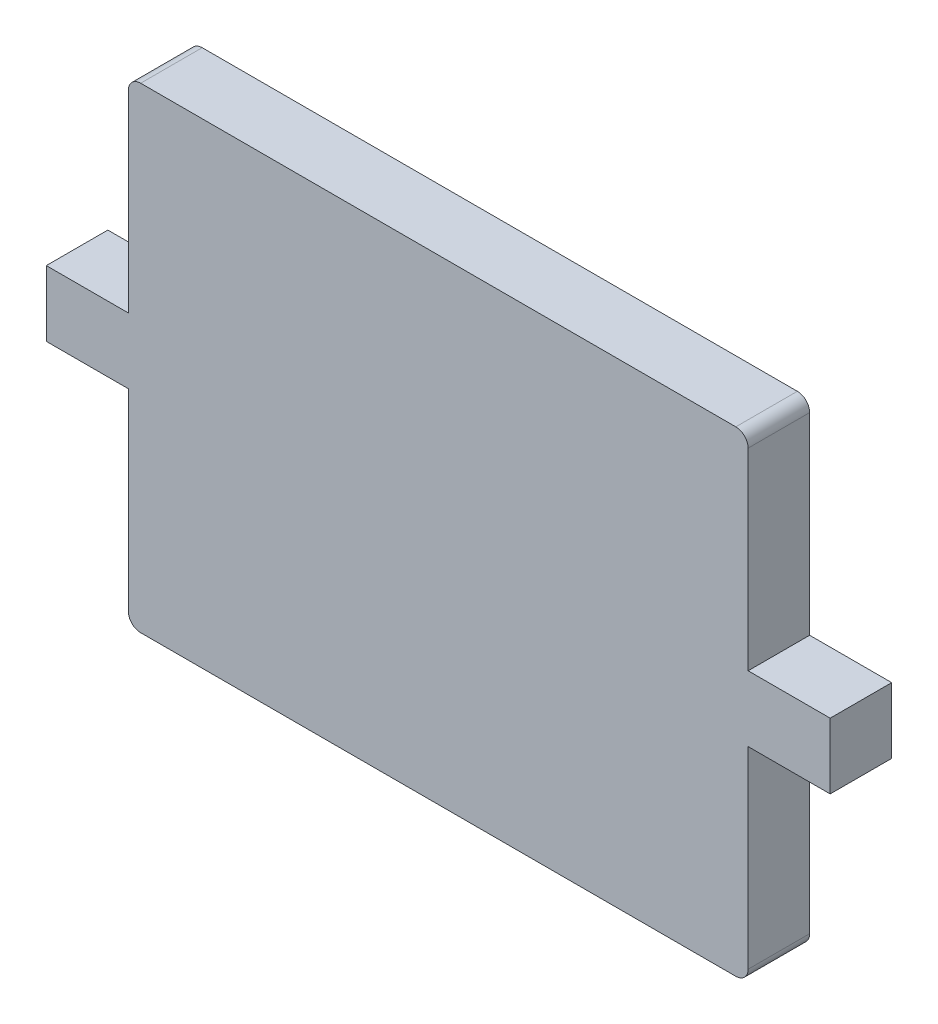
ISO-10303-21;
HEADER;
FILE_DESCRIPTION(('STEP AP214'),'2;1');
FILE_NAME('part.step','',(''),(''),'','','');
FILE_SCHEMA(('AUTOMOTIVE_DESIGN { 1 0 10303 214 1 1 1 1 }'));
ENDSEC;
DATA;
#1=APPLICATION_CONTEXT('core data for automotive mechanical design processes');
#2=APPLICATION_PROTOCOL_DEFINITION('international standard','automotive_design',2000,#1);
#3=PRODUCT_CONTEXT('',#1,'mechanical');
#4=PRODUCT('Part','Part','',(#3));
#5=PRODUCT_RELATED_PRODUCT_CATEGORY('part','',(#4));
#6=PRODUCT_DEFINITION_FORMATION('','',#4);
#7=PRODUCT_DEFINITION_CONTEXT('part definition',#1,'design');
#8=PRODUCT_DEFINITION('design','',#6,#7);
#9=PRODUCT_DEFINITION_SHAPE('','',#8);
#10=(LENGTH_UNIT() NAMED_UNIT(*) SI_UNIT(.MILLI.,.METRE.));
#11=(NAMED_UNIT(*) PLANE_ANGLE_UNIT() SI_UNIT($,.RADIAN.));
#12=(NAMED_UNIT(*) SI_UNIT($,.STERADIAN.) SOLID_ANGLE_UNIT());
#13=UNCERTAINTY_MEASURE_WITH_UNIT(LENGTH_MEASURE(1.E-05),#10,'distance_accuracy_value','');
#14=(GEOMETRIC_REPRESENTATION_CONTEXT(3) GLOBAL_UNCERTAINTY_ASSIGNED_CONTEXT((#13)) GLOBAL_UNIT_ASSIGNED_CONTEXT((#10,
#11,#12)) REPRESENTATION_CONTEXT('',''));
#15=CARTESIAN_POINT('',(0.,0.,0.));
#16=DIRECTION('',(0.,0.,1.));
#17=DIRECTION('',(1.,0.,0.));
#18=AXIS2_PLACEMENT_3D('',#15,#16,#17);
#19=CARTESIAN_POINT('',(10.2189684639324,2.74999999999999,1.5));
#20=DIRECTION('',(0.,0.,-1.));
#21=DIRECTION('',(-1.,0.,0.));
#22=AXIS2_PLACEMENT_3D('',#19,#20,#21);
#23=CYLINDRICAL_SURFACE('',#22,0.300000000000002);
#24=CARTESIAN_POINT('',(10.2189684639324,2.74999999999999,0.));
#25=DIRECTION('',(0.,0.,1.));
#26=DIRECTION('',(1.,0.,0.));
#27=AXIS2_PLACEMENT_3D('',#24,#25,#26);
#28=CIRCLE('',#27,0.300000000000002);
#29=CARTESIAN_POINT('',(10.5189684639324,2.74999999999999,0.));
#30=VERTEX_POINT('',#29);
#31=CARTESIAN_POINT('',(10.2189684639324,3.04999999999999,0.));
#32=VERTEX_POINT('',#31);
#33=EDGE_CURVE('E177',#30,#32,#28,.T.);
#34=ORIENTED_EDGE('',*,*,#33,.T.);
#35=DIRECTION('',(0.,0.,-1.));
#36=VECTOR('',#35,1.);
#37=CARTESIAN_POINT('',(10.2189684639324,3.04999999999999,1.5));
#38=LINE('',#37,#36);
#39=CARTESIAN_POINT('',(10.2189684639324,3.04999999999999,1.5));
#40=VERTEX_POINT('',#39);
#41=EDGE_CURVE('E11',#40,#32,#38,.T.);
#42=ORIENTED_EDGE('',*,*,#41,.F.);
#43=CARTESIAN_POINT('',(10.2189684639324,2.74999999999999,1.5));
#44=DIRECTION('',(0.,0.,1.));
#45=DIRECTION('',(1.,0.,0.));
#46=AXIS2_PLACEMENT_3D('',#43,#44,#45);
#47=CIRCLE('',#46,0.300000000000002);
#48=CARTESIAN_POINT('',(10.5189684639324,2.74999999999999,1.5));
#49=VERTEX_POINT('',#48);
#50=EDGE_CURVE('E207',#49,#40,#47,.T.);
#51=ORIENTED_EDGE('',*,*,#50,.F.);
#52=DIRECTION('',(0.,0.,-1.));
#53=VECTOR('',#52,1.);
#54=CARTESIAN_POINT('',(10.5189684639324,2.74999999999999,1.5));
#55=LINE('',#54,#53);
#56=EDGE_CURVE('E173',#49,#30,#55,.T.);
#57=ORIENTED_EDGE('',*,*,#56,.T.);
#58=EDGE_LOOP('',(#34,#42,#51,#57));
#59=FACE_BOUND('',#58,.T.);
#60=ADVANCED_FACE('F33',(#59),#23,.T.);
#61=CARTESIAN_POINT('',(10.2189684639324,3.04999999999999,1.5));
#62=DIRECTION('',(0.,-1.,0.));
#63=DIRECTION('',(1.,0.,0.));
#64=AXIS2_PLACEMENT_3D('',#61,#62,#63);
#65=PLANE('',#64);
#66=DIRECTION('',(-1.,0.,0.));
#67=VECTOR('',#66,1.);
#68=CARTESIAN_POINT('',(10.2189684639324,3.04999999999999,0.));
#69=LINE('',#68,#67);
#70=CARTESIAN_POINT('',(-4.28853958541714,3.04999999999999,0.));
#71=VERTEX_POINT('',#70);
#72=EDGE_CURVE('E180',#32,#71,#69,.T.);
#73=ORIENTED_EDGE('',*,*,#72,.T.);
#74=DIRECTION('',(0.,0.,-1.));
#75=VECTOR('',#74,1.);
#76=CARTESIAN_POINT('',(-4.28853958541714,3.04999999999999,1.5));
#77=LINE('',#76,#75);
#78=CARTESIAN_POINT('',(-4.28853958541714,3.04999999999999,1.5));
#79=VERTEX_POINT('',#78);
#80=EDGE_CURVE('E41',#79,#71,#77,.T.);
#81=ORIENTED_EDGE('',*,*,#80,.F.);
#82=DIRECTION('',(-1.,0.,0.));
#83=VECTOR('',#82,1.);
#84=CARTESIAN_POINT('',(10.2189684639324,3.04999999999999,1.5));
#85=LINE('',#84,#83);
#86=EDGE_CURVE('E116',#40,#79,#85,.T.);
#87=ORIENTED_EDGE('',*,*,#86,.F.);
#88=ORIENTED_EDGE('',*,*,#41,.T.);
#89=EDGE_LOOP('',(#73,#81,#87,#88));
#90=FACE_BOUND('',#89,.T.);
#91=ADVANCED_FACE('F305',(#90),#65,.F.);
#92=CARTESIAN_POINT('',(-4.28853958541714,2.74999999999999,1.5));
#93=DIRECTION('',(0.,0.,-1.));
#94=DIRECTION('',(-1.,0.,0.));
#95=AXIS2_PLACEMENT_3D('',#92,#93,#94);
#96=CYLINDRICAL_SURFACE('',#95,0.300000000000001);
#97=CARTESIAN_POINT('',(-4.28853958541714,2.74999999999999,0.));
#98=DIRECTION('',(0.,0.,1.));
#99=DIRECTION('',(1.,0.,0.));
#100=AXIS2_PLACEMENT_3D('',#97,#98,#99);
#101=CIRCLE('',#100,0.300000000000001);
#102=CARTESIAN_POINT('',(-4.58853958541714,2.74999999999999,0.));
#103=VERTEX_POINT('',#102);
#104=EDGE_CURVE('E182',#71,#103,#101,.T.);
#105=ORIENTED_EDGE('',*,*,#104,.T.);
#106=DIRECTION('',(0.,0.,-1.));
#107=VECTOR('',#106,1.);
#108=CARTESIAN_POINT('',(-4.58853958541714,2.74999999999999,1.5));
#109=LINE('',#108,#107);
#110=CARTESIAN_POINT('',(-4.58853958541714,2.74999999999999,1.5));
#111=VERTEX_POINT('',#110);
#112=EDGE_CURVE('E238',#111,#103,#109,.T.);
#113=ORIENTED_EDGE('',*,*,#112,.F.);
#114=CARTESIAN_POINT('',(-4.28853958541714,2.74999999999999,1.5));
#115=DIRECTION('',(0.,0.,1.));
#116=DIRECTION('',(1.,0.,0.));
#117=AXIS2_PLACEMENT_3D('',#114,#115,#116);
#118=CIRCLE('',#117,0.300000000000001);
#119=EDGE_CURVE('E246',#79,#111,#118,.T.);
#120=ORIENTED_EDGE('',*,*,#119,.F.);
#121=ORIENTED_EDGE('',*,*,#80,.T.);
#122=EDGE_LOOP('',(#105,#113,#120,#121));
#123=FACE_BOUND('',#122,.T.);
#124=ADVANCED_FACE('F244',(#123),#96,.T.);
#125=CARTESIAN_POINT('',(-4.58853958541714,2.74999999999999,1.5));
#126=DIRECTION('',(1.,0.,0.));
#127=DIRECTION('',(0.,0.,-1.));
#128=AXIS2_PLACEMENT_3D('',#125,#126,#127);
#129=PLANE('',#128);
#130=DIRECTION('',(0.,-1.,0.));
#131=VECTOR('',#130,1.);
#132=CARTESIAN_POINT('',(-4.58853958541714,2.74999999999999,0.));
#133=LINE('',#132,#131);
#134=CARTESIAN_POINT('',(-4.58853958541714,-1.95000000000001,0.));
#135=VERTEX_POINT('',#134);
#136=EDGE_CURVE('E184',#103,#135,#133,.T.);
#137=ORIENTED_EDGE('',*,*,#136,.T.);
#138=DIRECTION('',(0.,0.,-1.));
#139=VECTOR('',#138,1.);
#140=CARTESIAN_POINT('',(-4.58853958541714,-1.95000000000001,1.5));
#141=LINE('',#140,#139);
#142=CARTESIAN_POINT('',(-4.58853958541714,-1.95000000000001,1.5));
#143=VERTEX_POINT('',#142);
#144=EDGE_CURVE('E235',#143,#135,#141,.T.);
#145=ORIENTED_EDGE('',*,*,#144,.F.);
#146=DIRECTION('',(0.,-1.,0.));
#147=VECTOR('',#146,1.);
#148=CARTESIAN_POINT('',(-4.58853958541714,2.74999999999999,1.5));
#149=LINE('',#148,#147);
#150=EDGE_CURVE('E264',#111,#143,#149,.T.);
#151=ORIENTED_EDGE('',*,*,#150,.F.);
#152=ORIENTED_EDGE('',*,*,#112,.T.);
#153=EDGE_LOOP('',(#137,#145,#151,#152));
#154=FACE_BOUND('',#153,.T.);
#155=ADVANCED_FACE('F255',(#154),#129,.F.);
#156=CARTESIAN_POINT('',(-4.58853958541714,-1.95000000000001,1.5));
#157=DIRECTION('',(0.,-1.,0.));
#158=DIRECTION('',(1.,0.,0.));
#159=AXIS2_PLACEMENT_3D('',#156,#157,#158);
#160=PLANE('',#159);
#161=DIRECTION('',(-1.,0.,0.));
#162=VECTOR('',#161,1.);
#163=CARTESIAN_POINT('',(-4.58853958541714,-1.95000000000001,0.));
#164=LINE('',#163,#162);
#165=CARTESIAN_POINT('',(-6.58853958541714,-1.95000000000001,0.));
#166=VERTEX_POINT('',#165);
#167=EDGE_CURVE('E186',#135,#166,#164,.T.);
#168=ORIENTED_EDGE('',*,*,#167,.T.);
#169=DIRECTION('',(0.,0.,-1.));
#170=VECTOR('',#169,1.);
#171=CARTESIAN_POINT('',(-6.58853958541714,-1.95000000000001,1.5));
#172=LINE('',#171,#170);
#173=CARTESIAN_POINT('',(-6.58853958541714,-1.95000000000001,1.5));
#174=VERTEX_POINT('',#173);
#175=EDGE_CURVE('E232',#174,#166,#172,.T.);
#176=ORIENTED_EDGE('',*,*,#175,.F.);
#177=DIRECTION('',(-1.,0.,0.));
#178=VECTOR('',#177,1.);
#179=CARTESIAN_POINT('',(-4.58853958541714,-1.95000000000001,1.5));
#180=LINE('',#179,#178);
#181=EDGE_CURVE('E261',#143,#174,#180,.T.);
#182=ORIENTED_EDGE('',*,*,#181,.F.);
#183=ORIENTED_EDGE('',*,*,#144,.T.);
#184=EDGE_LOOP('',(#168,#176,#182,#183));
#185=FACE_BOUND('',#184,.T.);
#186=ADVANCED_FACE('F259',(#185),#160,.F.);
#187=CARTESIAN_POINT('',(-6.58853958541714,-1.95000000000001,1.5));
#188=DIRECTION('',(1.,0.,0.));
#189=DIRECTION('',(0.,0.,-1.));
#190=AXIS2_PLACEMENT_3D('',#187,#188,#189);
#191=PLANE('',#190);
#192=DIRECTION('',(0.,-1.,0.));
#193=VECTOR('',#192,1.);
#194=CARTESIAN_POINT('',(-6.58853958541714,-1.95000000000001,0.));
#195=LINE('',#194,#193);
#196=CARTESIAN_POINT('',(-6.58853958541714,-3.55000000000001,0.));
#197=VERTEX_POINT('',#196);
#198=EDGE_CURVE('E188',#166,#197,#195,.T.);
#199=ORIENTED_EDGE('',*,*,#198,.T.);
#200=DIRECTION('',(0.,0.,-1.));
#201=VECTOR('',#200,1.);
#202=CARTESIAN_POINT('',(-6.58853958541714,-3.55000000000001,1.5));
#203=LINE('',#202,#201);
#204=CARTESIAN_POINT('',(-6.58853958541714,-3.55000000000001,1.5));
#205=VERTEX_POINT('',#204);
#206=EDGE_CURVE('E229',#205,#197,#203,.T.);
#207=ORIENTED_EDGE('',*,*,#206,.F.);
#208=DIRECTION('',(0.,-1.,0.));
#209=VECTOR('',#208,1.);
#210=CARTESIAN_POINT('',(-6.58853958541714,-1.95000000000001,1.5));
#211=LINE('',#210,#209);
#212=EDGE_CURVE('E263',#174,#205,#211,.T.);
#213=ORIENTED_EDGE('',*,*,#212,.F.);
#214=ORIENTED_EDGE('',*,*,#175,.T.);
#215=EDGE_LOOP('',(#199,#207,#213,#214));
#216=FACE_BOUND('',#215,.T.);
#217=ADVANCED_FACE('F318',(#216),#191,.F.);
#218=CARTESIAN_POINT('',(-6.58853958541714,-3.55000000000001,1.5));
#219=DIRECTION('',(0.,1.,0.));
#220=DIRECTION('',(-1.,0.,0.));
#221=AXIS2_PLACEMENT_3D('',#218,#219,#220);
#222=PLANE('',#221);
#223=DIRECTION('',(1.,0.,0.));
#224=VECTOR('',#223,1.);
#225=CARTESIAN_POINT('',(-6.58853958541714,-3.55000000000001,0.));
#226=LINE('',#225,#224);
#227=CARTESIAN_POINT('',(-4.58853958541714,-3.55000000000001,0.));
#228=VERTEX_POINT('',#227);
#229=EDGE_CURVE('E190',#197,#228,#226,.T.);
#230=ORIENTED_EDGE('',*,*,#229,.T.);
#231=DIRECTION('',(0.,0.,-1.));
#232=VECTOR('',#231,1.);
#233=CARTESIAN_POINT('',(-4.58853958541714,-3.55000000000001,1.5));
#234=LINE('',#233,#232);
#235=CARTESIAN_POINT('',(-4.58853958541714,-3.55000000000001,1.5));
#236=VERTEX_POINT('',#235);
#237=EDGE_CURVE('E226',#236,#228,#234,.T.);
#238=ORIENTED_EDGE('',*,*,#237,.F.);
#239=DIRECTION('',(1.,0.,0.));
#240=VECTOR('',#239,1.);
#241=CARTESIAN_POINT('',(-6.58853958541714,-3.55000000000001,1.5));
#242=LINE('',#241,#240);
#243=EDGE_CURVE('E266',#205,#236,#242,.T.);
#244=ORIENTED_EDGE('',*,*,#243,.F.);
#245=ORIENTED_EDGE('',*,*,#206,.T.);
#246=EDGE_LOOP('',(#230,#238,#244,#245));
#247=FACE_BOUND('',#246,.T.);
#248=ADVANCED_FACE('F321',(#247),#222,.F.);
#249=CARTESIAN_POINT('',(-4.58853958541714,-3.55000000000001,1.5));
#250=DIRECTION('',(1.,0.,0.));
#251=DIRECTION('',(0.,0.,-1.));
#252=AXIS2_PLACEMENT_3D('',#249,#250,#251);
#253=PLANE('',#252);
#254=DIRECTION('',(0.,-1.,0.));
#255=VECTOR('',#254,1.);
#256=CARTESIAN_POINT('',(-4.58853958541714,-3.55000000000001,0.));
#257=LINE('',#256,#255);
#258=CARTESIAN_POINT('',(-4.58853958541714,-8.25000000000001,0.));
#259=VERTEX_POINT('',#258);
#260=EDGE_CURVE('E192',#228,#259,#257,.T.);
#261=ORIENTED_EDGE('',*,*,#260,.T.);
#262=DIRECTION('',(0.,0.,-1.));
#263=VECTOR('',#262,1.);
#264=CARTESIAN_POINT('',(-4.58853958541714,-8.25000000000001,1.5));
#265=LINE('',#264,#263);
#266=CARTESIAN_POINT('',(-4.58853958541714,-8.25000000000001,1.5));
#267=VERTEX_POINT('',#266);
#268=EDGE_CURVE('E223',#267,#259,#265,.T.);
#269=ORIENTED_EDGE('',*,*,#268,.F.);
#270=DIRECTION('',(0.,-1.,0.));
#271=VECTOR('',#270,1.);
#272=CARTESIAN_POINT('',(-4.58853958541714,-3.55000000000001,1.5));
#273=LINE('',#272,#271);
#274=EDGE_CURVE('E272',#236,#267,#273,.T.);
#275=ORIENTED_EDGE('',*,*,#274,.F.);
#276=ORIENTED_EDGE('',*,*,#237,.T.);
#277=EDGE_LOOP('',(#261,#269,#275,#276));
#278=FACE_BOUND('',#277,.T.);
#279=ADVANCED_FACE('F325',(#278),#253,.F.);
#280=CARTESIAN_POINT('',(-4.28853958541714,-8.25000000000001,1.5));
#281=DIRECTION('',(0.,0.,-1.));
#282=DIRECTION('',(-1.,0.,0.));
#283=AXIS2_PLACEMENT_3D('',#280,#281,#282);
#284=CYLINDRICAL_SURFACE('',#283,0.300000000000002);
#285=CARTESIAN_POINT('',(-4.28853958541714,-8.25000000000001,0.));
#286=DIRECTION('',(0.,0.,1.));
#287=DIRECTION('',(1.,0.,0.));
#288=AXIS2_PLACEMENT_3D('',#285,#286,#287);
#289=CIRCLE('',#288,0.300000000000002);
#290=CARTESIAN_POINT('',(-4.28853958541714,-8.55000000000001,0.));
#291=VERTEX_POINT('',#290);
#292=EDGE_CURVE('E194',#259,#291,#289,.T.);
#293=ORIENTED_EDGE('',*,*,#292,.T.);
#294=DIRECTION('',(0.,0.,-1.));
#295=VECTOR('',#294,1.);
#296=CARTESIAN_POINT('',(-4.28853958541714,-8.55000000000001,1.5));
#297=LINE('',#296,#295);
#298=CARTESIAN_POINT('',(-4.28853958541714,-8.55000000000001,1.5));
#299=VERTEX_POINT('',#298);
#300=EDGE_CURVE('E220',#299,#291,#297,.T.);
#301=ORIENTED_EDGE('',*,*,#300,.F.);
#302=CARTESIAN_POINT('',(-4.28853958541714,-8.25000000000001,1.5));
#303=DIRECTION('',(0.,0.,1.));
#304=DIRECTION('',(1.,0.,0.));
#305=AXIS2_PLACEMENT_3D('',#302,#303,#304);
#306=CIRCLE('',#305,0.300000000000002);
#307=EDGE_CURVE('E274',#267,#299,#306,.T.);
#308=ORIENTED_EDGE('',*,*,#307,.F.);
#309=ORIENTED_EDGE('',*,*,#268,.T.);
#310=EDGE_LOOP('',(#293,#301,#308,#309));
#311=FACE_BOUND('',#310,.T.);
#312=ADVANCED_FACE('F329',(#311),#284,.T.);
#313=CARTESIAN_POINT('',(-4.28853958541714,-8.55000000000001,1.5));
#314=DIRECTION('',(0.,1.,0.));
#315=DIRECTION('',(-1.,0.,0.));
#316=AXIS2_PLACEMENT_3D('',#313,#314,#315);
#317=PLANE('',#316);
#318=DIRECTION('',(1.,0.,0.));
#319=VECTOR('',#318,1.);
#320=CARTESIAN_POINT('',(-4.28853958541714,-8.55000000000001,0.));
#321=LINE('',#320,#319);
#322=CARTESIAN_POINT('',(10.2189684639324,-8.55000000000001,0.));
#323=VERTEX_POINT('',#322);
#324=EDGE_CURVE('E196',#291,#323,#321,.T.);
#325=ORIENTED_EDGE('',*,*,#324,.T.);
#326=DIRECTION('',(0.,0.,-1.));
#327=VECTOR('',#326,1.);
#328=CARTESIAN_POINT('',(10.2189684639324,-8.55000000000001,1.5));
#329=LINE('',#328,#327);
#330=CARTESIAN_POINT('',(10.2189684639324,-8.55000000000001,1.5));
#331=VERTEX_POINT('',#330);
#332=EDGE_CURVE('E217',#331,#323,#329,.T.);
#333=ORIENTED_EDGE('',*,*,#332,.F.);
#334=DIRECTION('',(1.,0.,0.));
#335=VECTOR('',#334,1.);
#336=CARTESIAN_POINT('',(-4.28853958541714,-8.55000000000001,1.5));
#337=LINE('',#336,#335);
#338=EDGE_CURVE('E276',#299,#331,#337,.T.);
#339=ORIENTED_EDGE('',*,*,#338,.F.);
#340=ORIENTED_EDGE('',*,*,#300,.T.);
#341=EDGE_LOOP('',(#325,#333,#339,#340));
#342=FACE_BOUND('',#341,.T.);
#343=ADVANCED_FACE('F333',(#342),#317,.F.);
#344=CARTESIAN_POINT('',(10.2189684639324,-8.25000000000001,1.5));
#345=DIRECTION('',(0.,0.,-1.));
#346=DIRECTION('',(-1.,0.,0.));
#347=AXIS2_PLACEMENT_3D('',#344,#345,#346);
#348=CYLINDRICAL_SURFACE('',#347,0.300000000000001);
#349=CARTESIAN_POINT('',(10.2189684639324,-8.25000000000001,0.));
#350=DIRECTION('',(0.,0.,1.));
#351=DIRECTION('',(1.,0.,0.));
#352=AXIS2_PLACEMENT_3D('',#349,#350,#351);
#353=CIRCLE('',#352,0.300000000000001);
#354=CARTESIAN_POINT('',(10.5189684639324,-8.25000000000001,0.));
#355=VERTEX_POINT('',#354);
#356=EDGE_CURVE('E198',#323,#355,#353,.T.);
#357=ORIENTED_EDGE('',*,*,#356,.T.);
#358=DIRECTION('',(0.,0.,-1.));
#359=VECTOR('',#358,1.);
#360=CARTESIAN_POINT('',(10.5189684639324,-8.25000000000001,1.5));
#361=LINE('',#360,#359);
#362=CARTESIAN_POINT('',(10.5189684639324,-8.25000000000001,1.5));
#363=VERTEX_POINT('',#362);
#364=EDGE_CURVE('E214',#363,#355,#361,.T.);
#365=ORIENTED_EDGE('',*,*,#364,.F.);
#366=CARTESIAN_POINT('',(10.2189684639324,-8.25000000000001,1.5));
#367=DIRECTION('',(0.,0.,1.));
#368=DIRECTION('',(1.,0.,0.));
#369=AXIS2_PLACEMENT_3D('',#366,#367,#368);
#370=CIRCLE('',#369,0.300000000000001);
#371=EDGE_CURVE('E278',#331,#363,#370,.T.);
#372=ORIENTED_EDGE('',*,*,#371,.F.);
#373=ORIENTED_EDGE('',*,*,#332,.T.);
#374=EDGE_LOOP('',(#357,#365,#372,#373));
#375=FACE_BOUND('',#374,.T.);
#376=ADVANCED_FACE('F337',(#375),#348,.T.);
#377=CARTESIAN_POINT('',(10.5189684639324,-8.25000000000001,1.5));
#378=DIRECTION('',(-1.,0.,0.));
#379=DIRECTION('',(0.,0.,1.));
#380=AXIS2_PLACEMENT_3D('',#377,#378,#379);
#381=PLANE('',#380);
#382=DIRECTION('',(0.,1.,0.));
#383=VECTOR('',#382,1.);
#384=CARTESIAN_POINT('',(10.5189684639324,-8.25000000000001,0.));
#385=LINE('',#384,#383);
#386=CARTESIAN_POINT('',(10.5189684639324,-3.55000000000001,0.));
#387=VERTEX_POINT('',#386);
#388=EDGE_CURVE('E200',#355,#387,#385,.T.);
#389=ORIENTED_EDGE('',*,*,#388,.T.);
#390=DIRECTION('',(0.,0.,-1.));
#391=VECTOR('',#390,1.);
#392=CARTESIAN_POINT('',(10.5189684639324,-3.55000000000001,1.5));
#393=LINE('',#392,#391);
#394=CARTESIAN_POINT('',(10.5189684639324,-3.55000000000001,1.5));
#395=VERTEX_POINT('',#394);
#396=EDGE_CURVE('E211',#395,#387,#393,.T.);
#397=ORIENTED_EDGE('',*,*,#396,.F.);
#398=DIRECTION('',(0.,1.,0.));
#399=VECTOR('',#398,1.);
#400=CARTESIAN_POINT('',(10.5189684639324,-8.25000000000001,1.5));
#401=LINE('',#400,#399);
#402=EDGE_CURVE('E280',#363,#395,#401,.T.);
#403=ORIENTED_EDGE('',*,*,#402,.F.);
#404=ORIENTED_EDGE('',*,*,#364,.T.);
#405=EDGE_LOOP('',(#389,#397,#403,#404));
#406=FACE_BOUND('',#405,.T.);
#407=ADVANCED_FACE('F286',(#406),#381,.F.);
#408=CARTESIAN_POINT('',(10.5189684639324,-3.55000000000001,1.5));
#409=DIRECTION('',(0.,1.,0.));
#410=DIRECTION('',(0.,0.,1.));
#411=AXIS2_PLACEMENT_3D('',#408,#409,#410);
#412=PLANE('',#411);
#413=DIRECTION('',(1.,0.,0.));
#414=VECTOR('',#413,1.);
#415=CARTESIAN_POINT('',(10.5189684639324,-3.55000000000001,0.));
#416=LINE('',#415,#414);
#417=CARTESIAN_POINT('',(12.5189684639324,-3.55000000000001,0.));
#418=VERTEX_POINT('',#417);
#419=EDGE_CURVE('E202',#387,#418,#416,.T.);
#420=ORIENTED_EDGE('',*,*,#419,.T.);
#421=DIRECTION('',(0.,0.,-1.));
#422=VECTOR('',#421,1.);
#423=CARTESIAN_POINT('',(12.5189684639324,-3.55000000000001,1.5));
#424=LINE('',#423,#422);
#425=CARTESIAN_POINT('',(12.5189684639324,-3.55000000000001,1.5));
#426=VERTEX_POINT('',#425);
#427=EDGE_CURVE('E168',#426,#418,#424,.T.);
#428=ORIENTED_EDGE('',*,*,#427,.F.);
#429=DIRECTION('',(1.,0.,0.));
#430=VECTOR('',#429,1.);
#431=CARTESIAN_POINT('',(10.5189684639324,-3.55000000000001,1.5));
#432=LINE('',#431,#430);
#433=EDGE_CURVE('E159',#395,#426,#432,.T.);
#434=ORIENTED_EDGE('',*,*,#433,.F.);
#435=ORIENTED_EDGE('',*,*,#396,.T.);
#436=EDGE_LOOP('',(#420,#428,#434,#435));
#437=FACE_BOUND('',#436,.T.);
#438=ADVANCED_FACE('F290',(#437),#412,.F.);
#439=CARTESIAN_POINT('',(12.5189684639324,-3.55000000000001,1.5));
#440=DIRECTION('',(-1.,0.,0.));
#441=DIRECTION('',(0.,0.,1.));
#442=AXIS2_PLACEMENT_3D('',#439,#440,#441);
#443=PLANE('',#442);
#444=DIRECTION('',(0.,1.,0.));
#445=VECTOR('',#444,1.);
#446=CARTESIAN_POINT('',(12.5189684639324,-3.55000000000001,0.));
#447=LINE('',#446,#445);
#448=CARTESIAN_POINT('',(12.5189684639324,-1.95000000000001,0.));
#449=VERTEX_POINT('',#448);
#450=EDGE_CURVE('E167',#418,#449,#447,.T.);
#451=ORIENTED_EDGE('',*,*,#450,.T.);
#452=DIRECTION('',(0.,0.,-1.));
#453=VECTOR('',#452,1.);
#454=CARTESIAN_POINT('',(12.5189684639324,-1.95000000000001,1.5));
#455=LINE('',#454,#453);
#456=CARTESIAN_POINT('',(12.5189684639324,-1.95000000000001,1.5));
#457=VERTEX_POINT('',#456);
#458=EDGE_CURVE('E164',#457,#449,#455,.T.);
#459=ORIENTED_EDGE('',*,*,#458,.F.);
#460=DIRECTION('',(0.,1.,0.));
#461=VECTOR('',#460,1.);
#462=CARTESIAN_POINT('',(12.5189684639324,-3.55000000000001,1.5));
#463=LINE('',#462,#461);
#464=EDGE_CURVE('E153',#426,#457,#463,.T.);
#465=ORIENTED_EDGE('',*,*,#464,.F.);
#466=ORIENTED_EDGE('',*,*,#427,.T.);
#467=EDGE_LOOP('',(#451,#459,#465,#466));
#468=FACE_BOUND('',#467,.T.);
#469=ADVANCED_FACE('F165',(#468),#443,.F.);
#470=CARTESIAN_POINT('',(12.5189684639324,-1.95000000000001,1.5));
#471=DIRECTION('',(0.,-1.,0.));
#472=DIRECTION('',(0.,0.,-1.));
#473=AXIS2_PLACEMENT_3D('',#470,#471,#472);
#474=PLANE('',#473);
#475=DIRECTION('',(-1.,0.,0.));
#476=VECTOR('',#475,1.);
#477=CARTESIAN_POINT('',(12.5189684639324,-1.95000000000001,0.));
#478=LINE('',#477,#476);
#479=CARTESIAN_POINT('',(10.5189684639324,-1.95000000000001,0.));
#480=VERTEX_POINT('',#479);
#481=EDGE_CURVE('E102',#449,#480,#478,.T.);
#482=ORIENTED_EDGE('',*,*,#481,.T.);
#483=DIRECTION('',(0.,0.,-1.));
#484=VECTOR('',#483,1.);
#485=CARTESIAN_POINT('',(10.5189684639324,-1.95000000000001,1.5));
#486=LINE('',#485,#484);
#487=CARTESIAN_POINT('',(10.5189684639324,-1.95000000000001,1.5));
#488=VERTEX_POINT('',#487);
#489=EDGE_CURVE('E169',#488,#480,#486,.T.);
#490=ORIENTED_EDGE('',*,*,#489,.F.);
#491=DIRECTION('',(-1.,0.,0.));
#492=VECTOR('',#491,1.);
#493=CARTESIAN_POINT('',(12.5189684639324,-1.95000000000001,1.5));
#494=LINE('',#493,#492);
#495=EDGE_CURVE('E157',#457,#488,#494,.T.);
#496=ORIENTED_EDGE('',*,*,#495,.F.);
#497=ORIENTED_EDGE('',*,*,#458,.T.);
#498=EDGE_LOOP('',(#482,#490,#496,#497));
#499=FACE_BOUND('',#498,.T.);
#500=ADVANCED_FACE('F171',(#499),#474,.F.);
#501=CARTESIAN_POINT('',(10.5189684639324,-1.95000000000001,1.5));
#502=DIRECTION('',(-1.,0.,0.));
#503=DIRECTION('',(0.,0.,1.));
#504=AXIS2_PLACEMENT_3D('',#501,#502,#503);
#505=PLANE('',#504);
#506=DIRECTION('',(0.,1.,0.));
#507=VECTOR('',#506,1.);
#508=CARTESIAN_POINT('',(10.5189684639324,-1.95000000000001,0.));
#509=LINE('',#508,#507);
#510=EDGE_CURVE('E108',#480,#30,#509,.T.);
#511=ORIENTED_EDGE('',*,*,#510,.T.);
#512=ORIENTED_EDGE('',*,*,#56,.F.);
#513=DIRECTION('',(0.,1.,0.));
#514=VECTOR('',#513,1.);
#515=CARTESIAN_POINT('',(10.5189684639324,-1.95000000000001,1.5));
#516=LINE('',#515,#514);
#517=EDGE_CURVE('E49',#488,#49,#516,.T.);
#518=ORIENTED_EDGE('',*,*,#517,.F.);
#519=ORIENTED_EDGE('',*,*,#489,.T.);
#520=EDGE_LOOP('',(#511,#512,#518,#519));
#521=FACE_BOUND('',#520,.T.);
#522=ADVANCED_FACE('F294',(#521),#505,.F.);
#523=CARTESIAN_POINT('',(10.2189684639324,2.74999999999999,1.5));
#524=DIRECTION('',(0.,0.,1.));
#525=DIRECTION('',(1.,0.,0.));
#526=AXIS2_PLACEMENT_3D('',#523,#524,#525);
#527=PLANE('',#526);
#528=ORIENTED_EDGE('',*,*,#50,.T.);
#529=ORIENTED_EDGE('',*,*,#86,.T.);
#530=ORIENTED_EDGE('',*,*,#119,.T.);
#531=ORIENTED_EDGE('',*,*,#150,.T.);
#532=ORIENTED_EDGE('',*,*,#181,.T.);
#533=ORIENTED_EDGE('',*,*,#212,.T.);
#534=ORIENTED_EDGE('',*,*,#243,.T.);
#535=ORIENTED_EDGE('',*,*,#274,.T.);
#536=ORIENTED_EDGE('',*,*,#307,.T.);
#537=ORIENTED_EDGE('',*,*,#338,.T.);
#538=ORIENTED_EDGE('',*,*,#371,.T.);
#539=ORIENTED_EDGE('',*,*,#402,.T.);
#540=ORIENTED_EDGE('',*,*,#433,.T.);
#541=ORIENTED_EDGE('',*,*,#464,.T.);
#542=ORIENTED_EDGE('',*,*,#495,.T.);
#543=ORIENTED_EDGE('',*,*,#517,.T.);
#544=EDGE_LOOP('',(#528,#529,#530,#531,#532,#533,#534,#535,#536,#537,#538,#539,#540,#541,#542,#543));
#545=FACE_BOUND('',#544,.T.);
#546=ADVANCED_FACE('F155',(#545),#527,.T.);
#547=CARTESIAN_POINT('',(10.2189684639324,2.74999999999999,0.));
#548=DIRECTION('',(0.,0.,1.));
#549=DIRECTION('',(1.,0.,0.));
#550=AXIS2_PLACEMENT_3D('',#547,#548,#549);
#551=PLANE('',#550);
#552=ORIENTED_EDGE('',*,*,#33,.F.);
#553=ORIENTED_EDGE('',*,*,#510,.F.);
#554=ORIENTED_EDGE('',*,*,#481,.F.);
#555=ORIENTED_EDGE('',*,*,#450,.F.);
#556=ORIENTED_EDGE('',*,*,#419,.F.);
#557=ORIENTED_EDGE('',*,*,#388,.F.);
#558=ORIENTED_EDGE('',*,*,#356,.F.);
#559=ORIENTED_EDGE('',*,*,#324,.F.);
#560=ORIENTED_EDGE('',*,*,#292,.F.);
#561=ORIENTED_EDGE('',*,*,#260,.F.);
#562=ORIENTED_EDGE('',*,*,#229,.F.);
#563=ORIENTED_EDGE('',*,*,#198,.F.);
#564=ORIENTED_EDGE('',*,*,#167,.F.);
#565=ORIENTED_EDGE('',*,*,#136,.F.);
#566=ORIENTED_EDGE('',*,*,#104,.F.);
#567=ORIENTED_EDGE('',*,*,#72,.F.);
#568=EDGE_LOOP('',(#552,#553,#554,#555,#556,#557,#558,#559,#560,#561,#562,#563,#564,#565,#566,#567));
#569=FACE_BOUND('',#568,.T.);
#570=ADVANCED_FACE('F250',(#569),#551,.F.);
#571=CLOSED_SHELL('',(#60,#91,#124,#155,#186,#217,#248,#279,#312,#343,#376,#407,#438,#469,#500,
#522,#546,#570));
#572=MANIFOLD_SOLID_BREP('B2',#571);
#573=ADVANCED_BREP_SHAPE_REPRESENTATION('',(#18,#572),#14);
#574=SHAPE_DEFINITION_REPRESENTATION(#9,#573);
ENDSEC;
END-ISO-10303-21;
